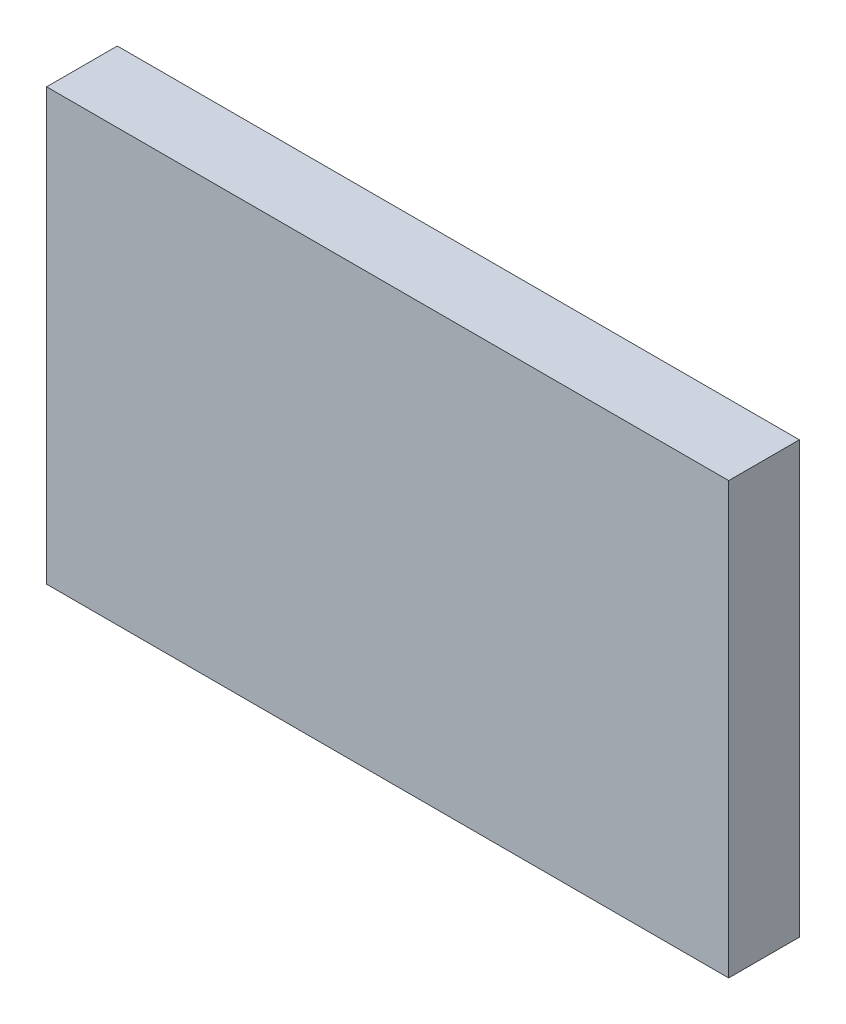
ISO-10303-21;
HEADER;
FILE_DESCRIPTION(('STEP AP214'),'2;1');
FILE_NAME('part.step','',(''),(''),'','','');
FILE_SCHEMA(('AUTOMOTIVE_DESIGN { 1 0 10303 214 1 1 1 1 }'));
ENDSEC;
DATA;
#1=APPLICATION_CONTEXT('core data for automotive mechanical design processes');
#2=APPLICATION_PROTOCOL_DEFINITION('international standard','automotive_design',2000,#1);
#3=PRODUCT_CONTEXT('',#1,'mechanical');
#4=PRODUCT('Part','Part','',(#3));
#5=PRODUCT_RELATED_PRODUCT_CATEGORY('part','',(#4));
#6=PRODUCT_DEFINITION_FORMATION('','',#4);
#7=PRODUCT_DEFINITION_CONTEXT('part definition',#1,'design');
#8=PRODUCT_DEFINITION('design','',#6,#7);
#9=PRODUCT_DEFINITION_SHAPE('','',#8);
#10=(LENGTH_UNIT() NAMED_UNIT(*) SI_UNIT(.MILLI.,.METRE.));
#11=(NAMED_UNIT(*) PLANE_ANGLE_UNIT() SI_UNIT($,.RADIAN.));
#12=(NAMED_UNIT(*) SI_UNIT($,.STERADIAN.) SOLID_ANGLE_UNIT());
#13=UNCERTAINTY_MEASURE_WITH_UNIT(LENGTH_MEASURE(1.E-05),#10,'distance_accuracy_value','');
#14=(GEOMETRIC_REPRESENTATION_CONTEXT(3) GLOBAL_UNCERTAINTY_ASSIGNED_CONTEXT((#13)) GLOBAL_UNIT_ASSIGNED_CONTEXT((#10,
#11,#12)) REPRESENTATION_CONTEXT('',''));
#15=CARTESIAN_POINT('',(0.,0.,0.));
#16=DIRECTION('',(0.,0.,1.));
#17=DIRECTION('',(1.,0.,0.));
#18=AXIS2_PLACEMENT_3D('',#15,#16,#17);
#19=CARTESIAN_POINT('',(-4.826,-3.048,1.));
#20=DIRECTION('',(1.,0.,0.));
#21=DIRECTION('',(0.,0.,-1.));
#22=AXIS2_PLACEMENT_3D('',#19,#20,#21);
#23=PLANE('',#22);
#24=DIRECTION('',(0.,-1.,0.));
#25=VECTOR('',#24,1.);
#26=CARTESIAN_POINT('',(-4.826,-3.048,0.));
#27=LINE('',#26,#25);
#28=CARTESIAN_POINT('',(-4.826,3.048,0.));
#29=VERTEX_POINT('',#28);
#30=CARTESIAN_POINT('',(-4.826,-3.048,0.));
#31=VERTEX_POINT('',#30);
#32=EDGE_CURVE('E95',#29,#31,#27,.T.);
#33=ORIENTED_EDGE('',*,*,#32,.T.);
#34=DIRECTION('',(0.,0.,-1.));
#35=VECTOR('',#34,1.);
#36=CARTESIAN_POINT('',(-4.826,-3.048,1.));
#37=LINE('',#36,#35);
#38=CARTESIAN_POINT('',(-4.826,-3.048,1.));
#39=VERTEX_POINT('',#38);
#40=EDGE_CURVE('E11',#39,#31,#37,.T.);
#41=ORIENTED_EDGE('',*,*,#40,.F.);
#42=DIRECTION('',(0.,-1.,0.));
#43=VECTOR('',#42,1.);
#44=CARTESIAN_POINT('',(-4.826,-3.048,1.));
#45=LINE('',#44,#43);
#46=CARTESIAN_POINT('',(-4.826,3.048,1.));
#47=VERTEX_POINT('',#46);
#48=EDGE_CURVE('E83',#47,#39,#45,.T.);
#49=ORIENTED_EDGE('',*,*,#48,.F.);
#50=DIRECTION('',(0.,0.,-1.));
#51=VECTOR('',#50,1.);
#52=CARTESIAN_POINT('',(-4.826,3.048,1.));
#53=LINE('',#52,#51);
#54=EDGE_CURVE('E91',#47,#29,#53,.T.);
#55=ORIENTED_EDGE('',*,*,#54,.T.);
#56=EDGE_LOOP('',(#33,#41,#49,#55));
#57=FACE_BOUND('',#56,.T.);
#58=ADVANCED_FACE('F32',(#57),#23,.F.);
#59=CARTESIAN_POINT('',(4.826,-3.048,1.));
#60=DIRECTION('',(0.,1.,0.));
#61=DIRECTION('',(0.,0.,1.));
#62=AXIS2_PLACEMENT_3D('',#59,#60,#61);
#63=PLANE('',#62);
#64=DIRECTION('',(1.,0.,0.));
#65=VECTOR('',#64,1.);
#66=CARTESIAN_POINT('',(4.826,-3.048,0.));
#67=LINE('',#66,#65);
#68=CARTESIAN_POINT('',(4.826,-3.048,0.));
#69=VERTEX_POINT('',#68);
#70=EDGE_CURVE('E87',#31,#69,#67,.T.);
#71=ORIENTED_EDGE('',*,*,#70,.T.);
#72=DIRECTION('',(0.,0.,-1.));
#73=VECTOR('',#72,1.);
#74=CARTESIAN_POINT('',(4.826,-3.048,1.));
#75=LINE('',#74,#73);
#76=CARTESIAN_POINT('',(4.826,-3.048,1.));
#77=VERTEX_POINT('',#76);
#78=EDGE_CURVE('E40',#77,#69,#75,.T.);
#79=ORIENTED_EDGE('',*,*,#78,.F.);
#80=DIRECTION('',(1.,0.,0.));
#81=VECTOR('',#80,1.);
#82=CARTESIAN_POINT('',(4.826,-3.048,1.));
#83=LINE('',#82,#81);
#84=EDGE_CURVE('E78',#39,#77,#83,.T.);
#85=ORIENTED_EDGE('',*,*,#84,.F.);
#86=ORIENTED_EDGE('',*,*,#40,.T.);
#87=EDGE_LOOP('',(#71,#79,#85,#86));
#88=FACE_BOUND('',#87,.T.);
#89=ADVANCED_FACE('F86',(#88),#63,.F.);
#90=CARTESIAN_POINT('',(4.826,3.048,1.));
#91=DIRECTION('',(-1.,0.,0.));
#92=DIRECTION('',(0.,0.,1.));
#93=AXIS2_PLACEMENT_3D('',#90,#91,#92);
#94=PLANE('',#93);
#95=DIRECTION('',(0.,1.,0.));
#96=VECTOR('',#95,1.);
#97=CARTESIAN_POINT('',(4.826,3.048,0.));
#98=LINE('',#97,#96);
#99=CARTESIAN_POINT('',(4.826,3.048,0.));
#100=VERTEX_POINT('',#99);
#101=EDGE_CURVE('E65',#69,#100,#98,.T.);
#102=ORIENTED_EDGE('',*,*,#101,.T.);
#103=DIRECTION('',(0.,0.,-1.));
#104=VECTOR('',#103,1.);
#105=CARTESIAN_POINT('',(4.826,3.048,1.));
#106=LINE('',#105,#104);
#107=CARTESIAN_POINT('',(4.826,3.048,1.));
#108=VERTEX_POINT('',#107);
#109=EDGE_CURVE('E88',#108,#100,#106,.T.);
#110=ORIENTED_EDGE('',*,*,#109,.F.);
#111=DIRECTION('',(0.,1.,0.));
#112=VECTOR('',#111,1.);
#113=CARTESIAN_POINT('',(4.826,3.048,1.));
#114=LINE('',#113,#112);
#115=EDGE_CURVE('E81',#77,#108,#114,.T.);
#116=ORIENTED_EDGE('',*,*,#115,.F.);
#117=ORIENTED_EDGE('',*,*,#78,.T.);
#118=EDGE_LOOP('',(#102,#110,#116,#117));
#119=FACE_BOUND('',#118,.T.);
#120=ADVANCED_FACE('F89',(#119),#94,.F.);
#121=CARTESIAN_POINT('',(-4.826,3.048,1.));
#122=DIRECTION('',(0.,-1.,0.));
#123=DIRECTION('',(0.,0.,-1.));
#124=AXIS2_PLACEMENT_3D('',#121,#122,#123);
#125=PLANE('',#124);
#126=DIRECTION('',(-1.,0.,0.));
#127=VECTOR('',#126,1.);
#128=CARTESIAN_POINT('',(-4.826,3.048,0.));
#129=LINE('',#128,#127);
#130=EDGE_CURVE('E71',#100,#29,#129,.T.);
#131=ORIENTED_EDGE('',*,*,#130,.T.);
#132=ORIENTED_EDGE('',*,*,#54,.F.);
#133=DIRECTION('',(-1.,0.,0.));
#134=VECTOR('',#133,1.);
#135=CARTESIAN_POINT('',(-4.826,3.048,1.));
#136=LINE('',#135,#134);
#137=EDGE_CURVE('E48',#108,#47,#136,.T.);
#138=ORIENTED_EDGE('',*,*,#137,.F.);
#139=ORIENTED_EDGE('',*,*,#109,.T.);
#140=EDGE_LOOP('',(#131,#132,#138,#139));
#141=FACE_BOUND('',#140,.T.);
#142=ADVANCED_FACE('F102',(#141),#125,.F.);
#143=CARTESIAN_POINT('',(0.,0.,1.));
#144=DIRECTION('',(0.,0.,-1.));
#145=DIRECTION('',(-1.,0.,0.));
#146=AXIS2_PLACEMENT_3D('',#143,#144,#145);
#147=PLANE('',#146);
#148=ORIENTED_EDGE('',*,*,#48,.T.);
#149=ORIENTED_EDGE('',*,*,#84,.T.);
#150=ORIENTED_EDGE('',*,*,#115,.T.);
#151=ORIENTED_EDGE('',*,*,#137,.T.);
#152=EDGE_LOOP('',(#148,#149,#150,#151));
#153=FACE_BOUND('',#152,.T.);
#154=ADVANCED_FACE('F79',(#153),#147,.F.);
#155=CARTESIAN_POINT('',(0.,0.,0.));
#156=DIRECTION('',(0.,0.,-1.));
#157=DIRECTION('',(-1.,0.,0.));
#158=AXIS2_PLACEMENT_3D('',#155,#156,#157);
#159=PLANE('',#158);
#160=ORIENTED_EDGE('',*,*,#32,.F.);
#161=ORIENTED_EDGE('',*,*,#130,.F.);
#162=ORIENTED_EDGE('',*,*,#101,.F.);
#163=ORIENTED_EDGE('',*,*,#70,.F.);
#164=EDGE_LOOP('',(#160,#161,#162,#163));
#165=FACE_BOUND('',#164,.T.);
#166=ADVANCED_FACE('F105',(#165),#159,.T.);
#167=CLOSED_SHELL('',(#58,#89,#120,#142,#154,#166));
#168=MANIFOLD_SOLID_BREP('B2',#167);
#169=ADVANCED_BREP_SHAPE_REPRESENTATION('',(#18,#168),#14);
#170=SHAPE_DEFINITION_REPRESENTATION(#9,#169);
ENDSEC;
END-ISO-10303-21;
